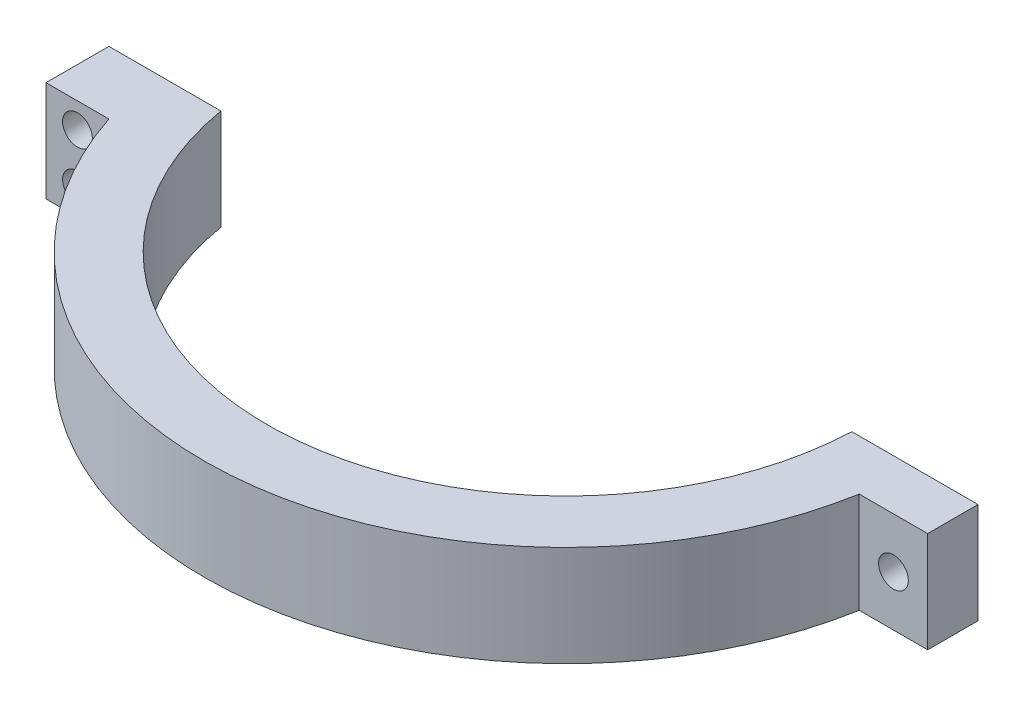
ISO-10303-21;
HEADER;
FILE_DESCRIPTION(('STEP AP214'),'2;1');
FILE_NAME('part.step','',(''),(''),'','','');
FILE_SCHEMA(('AUTOMOTIVE_DESIGN { 1 0 10303 214 1 1 1 1 }'));
ENDSEC;
DATA;
#1=APPLICATION_CONTEXT('core data for automotive mechanical design processes');
#2=APPLICATION_PROTOCOL_DEFINITION('international standard','automotive_design',2000,#1);
#3=PRODUCT_CONTEXT('',#1,'mechanical');
#4=PRODUCT('Part','Part','',(#3));
#5=PRODUCT_RELATED_PRODUCT_CATEGORY('part','',(#4));
#6=PRODUCT_DEFINITION_FORMATION('','',#4);
#7=PRODUCT_DEFINITION_CONTEXT('part definition',#1,'design');
#8=PRODUCT_DEFINITION('design','',#6,#7);
#9=PRODUCT_DEFINITION_SHAPE('','',#8);
#10=(LENGTH_UNIT() NAMED_UNIT(*) SI_UNIT(.MILLI.,.METRE.));
#11=(NAMED_UNIT(*) PLANE_ANGLE_UNIT() SI_UNIT($,.RADIAN.));
#12=(NAMED_UNIT(*) SI_UNIT($,.STERADIAN.) SOLID_ANGLE_UNIT());
#13=UNCERTAINTY_MEASURE_WITH_UNIT(LENGTH_MEASURE(1.E-05),#10,'distance_accuracy_value','');
#14=(GEOMETRIC_REPRESENTATION_CONTEXT(3) GLOBAL_UNCERTAINTY_ASSIGNED_CONTEXT((#13)) GLOBAL_UNIT_ASSIGNED_CONTEXT((#10,
#11,#12)) REPRESENTATION_CONTEXT('',''));
#15=CARTESIAN_POINT('',(0.,0.,0.));
#16=DIRECTION('',(0.,0.,1.));
#17=DIRECTION('',(1.,0.,0.));
#18=AXIS2_PLACEMENT_3D('',#15,#16,#17);
#19=CARTESIAN_POINT('',(0.,10.16,0.));
#20=DIRECTION('',(-1.,0.,0.));
#21=DIRECTION('',(0.,0.,1.));
#22=AXIS2_PLACEMENT_3D('',#19,#20,#21);
#23=PLANE('',#22);
#24=DIRECTION('',(0.,0.,-1.));
#25=VECTOR('',#24,1.);
#26=CARTESIAN_POINT('',(0.,0.,0.));
#27=LINE('',#26,#25);
#28=CARTESIAN_POINT('',(0.,0.,6.35));
#29=VERTEX_POINT('',#28);
#30=CARTESIAN_POINT('',(0.,0.,1.27));
#31=VERTEX_POINT('',#30);
#32=EDGE_CURVE('E139',#29,#31,#27,.T.);
#33=ORIENTED_EDGE('',*,*,#32,.T.);
#34=DIRECTION('',(0.,-1.,0.));
#35=VECTOR('',#34,1.);
#36=CARTESIAN_POINT('',(0.,10.16,1.27));
#37=LINE('',#36,#35);
#38=CARTESIAN_POINT('',(0.,10.16,1.27));
#39=VERTEX_POINT('',#38);
#40=EDGE_CURVE('E56',#39,#31,#37,.T.);
#41=ORIENTED_EDGE('',*,*,#40,.F.);
#42=DIRECTION('',(0.,0.,-1.));
#43=VECTOR('',#42,1.);
#44=CARTESIAN_POINT('',(0.,10.16,0.));
#45=LINE('',#44,#43);
#46=CARTESIAN_POINT('',(0.,10.16,6.35));
#47=VERTEX_POINT('',#46);
#48=EDGE_CURVE('E153',#47,#39,#45,.T.);
#49=ORIENTED_EDGE('',*,*,#48,.F.);
#50=DIRECTION('',(0.,-1.,0.));
#51=VECTOR('',#50,1.);
#52=CARTESIAN_POINT('',(0.,10.16,6.35));
#53=LINE('',#52,#51);
#54=EDGE_CURVE('E135',#47,#29,#53,.T.);
#55=ORIENTED_EDGE('',*,*,#54,.T.);
#56=EDGE_LOOP('',(#33,#41,#49,#55));
#57=FACE_BOUND('',#56,.T.);
#58=ADVANCED_FACE('F40',(#57),#23,.F.);
#59=CARTESIAN_POINT('',(-42.8625,10.16,0.));
#60=DIRECTION('',(0.,-1.,0.));
#61=DIRECTION('',(0.,0.,-1.));
#62=AXIS2_PLACEMENT_3D('',#59,#60,#61);
#63=CYLINDRICAL_SURFACE('',#62,30.1625);
#64=CARTESIAN_POINT('',(-42.8625,10.16,0.));
#65=DIRECTION('',(0.,-1.,0.));
#66=DIRECTION('',(0.,0.,-1.));
#67=AXIS2_PLACEMENT_3D('',#64,#65,#66);
#68=CIRCLE('',#67,30.1625);
#69=CARTESIAN_POINT('',(-12.7267487027451,10.16,1.27000000000001));
#70=VERTEX_POINT('',#69);
#71=CARTESIAN_POINT('',(-72.594133090868,10.16,5.08000000000001));
#72=VERTEX_POINT('',#71);
#73=EDGE_CURVE('E100',#70,#72,#68,.T.);
#74=ORIENTED_EDGE('',*,*,#73,.F.);
#75=DIRECTION('',(0.,-1.,0.));
#76=VECTOR('',#75,1.);
#77=CARTESIAN_POINT('',(-12.7267487027451,10.16,1.27000000000001));
#78=LINE('',#77,#76);
#79=CARTESIAN_POINT('',(-12.7267487027451,0.,1.27000000000001));
#80=VERTEX_POINT('',#79);
#81=EDGE_CURVE('E205',#70,#80,#78,.T.);
#82=ORIENTED_EDGE('',*,*,#81,.T.);
#83=CARTESIAN_POINT('',(-42.8625,0.,0.));
#84=DIRECTION('',(0.,-1.,0.));
#85=DIRECTION('',(0.,0.,-1.));
#86=AXIS2_PLACEMENT_3D('',#83,#84,#85);
#87=CIRCLE('',#86,30.1625);
#88=CARTESIAN_POINT('',(-72.594133090868,0.,5.08000000000001));
#89=VERTEX_POINT('',#88);
#90=EDGE_CURVE('E142',#80,#89,#87,.T.);
#91=ORIENTED_EDGE('',*,*,#90,.T.);
#92=DIRECTION('',(0.,-1.,0.));
#93=VECTOR('',#92,1.);
#94=CARTESIAN_POINT('',(-72.594133090868,10.16,5.08000000000001));
#95=LINE('',#94,#93);
#96=EDGE_CURVE('E11',#72,#89,#95,.T.);
#97=ORIENTED_EDGE('',*,*,#96,.F.);
#98=EDGE_LOOP('',(#74,#82,#91,#97));
#99=FACE_BOUND('',#98,.T.);
#100=ADVANCED_FACE('F185',(#99),#63,.F.);
#101=CARTESIAN_POINT('',(-72.594133090868,10.16,5.07999999999999));
#102=DIRECTION('',(0.,0.,1.));
#103=DIRECTION('',(1.,0.,0.));
#104=AXIS2_PLACEMENT_3D('',#101,#102,#103);
#105=PLANE('',#104);
#106=CARTESIAN_POINT('',(-80.7148377906955,7.62,5.08000000000002));
#107=DIRECTION('',(0.,0.,-1.));
#108=DIRECTION('',(-1.,0.,0.));
#109=AXIS2_PLACEMENT_3D('',#106,#107,#108);
#110=CIRCLE('',#109,1.5);
#111=CARTESIAN_POINT('',(-82.2148377906955,7.62,5.08000000000002));
#112=VERTEX_POINT('',#111);
#113=EDGE_CURVE('E161',#112,#112,#110,.T.);
#114=ORIENTED_EDGE('',*,*,#113,.F.);
#115=EDGE_LOOP('',(#114));
#116=FACE_BOUND('',#115,.T.);
#117=CARTESIAN_POINT('',(-80.7148377906955,2.54,5.08000000000002));
#118=DIRECTION('',(0.,0.,-1.));
#119=DIRECTION('',(-1.,0.,0.));
#120=AXIS2_PLACEMENT_3D('',#117,#118,#119);
#121=CIRCLE('',#120,1.5);
#122=CARTESIAN_POINT('',(-82.2148377906955,2.54,5.08000000000002));
#123=VERTEX_POINT('',#122);
#124=EDGE_CURVE('E211',#123,#123,#121,.T.);
#125=ORIENTED_EDGE('',*,*,#124,.F.);
#126=EDGE_LOOP('',(#125));
#127=FACE_BOUND('',#126,.T.);
#128=DIRECTION('',(-1.,0.,0.));
#129=VECTOR('',#128,1.);
#130=CARTESIAN_POINT('',(-72.594133090868,0.,5.07999999999999));
#131=LINE('',#130,#129);
#132=CARTESIAN_POINT('',(-83.8898377906955,0.,5.07999999999999));
#133=VERTEX_POINT('',#132);
#134=EDGE_CURVE('E145',#89,#133,#131,.T.);
#135=ORIENTED_EDGE('',*,*,#134,.T.);
#136=DIRECTION('',(0.,-1.,0.));
#137=VECTOR('',#136,1.);
#138=CARTESIAN_POINT('',(-83.8898377906955,10.16,5.07999999999999));
#139=LINE('',#138,#137);
#140=CARTESIAN_POINT('',(-83.8898377906955,10.16,5.07999999999999));
#141=VERTEX_POINT('',#140);
#142=EDGE_CURVE('E48',#141,#133,#139,.T.);
#143=ORIENTED_EDGE('',*,*,#142,.F.);
#144=DIRECTION('',(-1.,0.,0.));
#145=VECTOR('',#144,1.);
#146=CARTESIAN_POINT('',(-72.594133090868,10.16,5.07999999999999));
#147=LINE('',#146,#145);
#148=EDGE_CURVE('E217',#72,#141,#147,.T.);
#149=ORIENTED_EDGE('',*,*,#148,.F.);
#150=ORIENTED_EDGE('',*,*,#96,.T.);
#151=EDGE_LOOP('',(#135,#143,#149,#150));
#152=FACE_BOUND('',#151,.T.);
#153=ADVANCED_FACE('F190',(#116,#127,#152),#105,.F.);
#154=CARTESIAN_POINT('',(-83.8898377906955,10.16,5.07999999999999));
#155=DIRECTION('',(1.,0.,0.));
#156=DIRECTION('',(0.,0.,-1.));
#157=AXIS2_PLACEMENT_3D('',#154,#155,#156);
#158=PLANE('',#157);
#159=DIRECTION('',(0.,0.,1.));
#160=VECTOR('',#159,1.);
#161=CARTESIAN_POINT('',(-83.8898377906955,0.,5.07999999999999));
#162=LINE('',#161,#160);
#163=CARTESIAN_POINT('',(-83.8898377906955,0.,11.43));
#164=VERTEX_POINT('',#163);
#165=EDGE_CURVE('E147',#133,#164,#162,.T.);
#166=ORIENTED_EDGE('',*,*,#165,.T.);
#167=DIRECTION('',(0.,-1.,0.));
#168=VECTOR('',#167,1.);
#169=CARTESIAN_POINT('',(-83.8898377906955,10.16,11.43));
#170=LINE('',#169,#168);
#171=CARTESIAN_POINT('',(-83.8898377906955,10.16,11.43));
#172=VERTEX_POINT('',#171);
#173=EDGE_CURVE('E130',#172,#164,#170,.T.);
#174=ORIENTED_EDGE('',*,*,#173,.F.);
#175=DIRECTION('',(0.,0.,1.));
#176=VECTOR('',#175,1.);
#177=CARTESIAN_POINT('',(-83.8898377906955,10.16,5.07999999999999));
#178=LINE('',#177,#176);
#179=EDGE_CURVE('E118',#141,#172,#178,.T.);
#180=ORIENTED_EDGE('',*,*,#179,.F.);
#181=ORIENTED_EDGE('',*,*,#142,.T.);
#182=EDGE_LOOP('',(#166,#174,#180,#181));
#183=FACE_BOUND('',#182,.T.);
#184=ADVANCED_FACE('F223',(#183),#158,.F.);
#185=CARTESIAN_POINT('',(-83.8898377906955,10.16,11.43));
#186=DIRECTION('',(0.,0.,-1.));
#187=DIRECTION('',(-1.,0.,0.));
#188=AXIS2_PLACEMENT_3D('',#185,#186,#187);
#189=PLANE('',#188);
#190=CARTESIAN_POINT('',(-80.7148377906955,7.62,11.43));
#191=DIRECTION('',(0.,0.,-1.));
#192=DIRECTION('',(-1.,0.,0.));
#193=AXIS2_PLACEMENT_3D('',#190,#191,#192);
#194=CIRCLE('',#193,1.5);
#195=CARTESIAN_POINT('',(-82.2148377906955,7.62,11.43));
#196=VERTEX_POINT('',#195);
#197=EDGE_CURVE('E143',#196,#196,#194,.T.);
#198=ORIENTED_EDGE('',*,*,#197,.T.);
#199=EDGE_LOOP('',(#198));
#200=FACE_BOUND('',#199,.T.);
#201=CARTESIAN_POINT('',(-80.7148377906955,2.54,11.43));
#202=DIRECTION('',(0.,0.,-1.));
#203=DIRECTION('',(-1.,0.,0.));
#204=AXIS2_PLACEMENT_3D('',#201,#202,#203);
#205=CIRCLE('',#204,1.5);
#206=CARTESIAN_POINT('',(-82.2148377906955,2.54,11.43));
#207=VERTEX_POINT('',#206);
#208=EDGE_CURVE('E159',#207,#207,#205,.T.);
#209=ORIENTED_EDGE('',*,*,#208,.T.);
#210=EDGE_LOOP('',(#209));
#211=FACE_BOUND('',#210,.T.);
#212=DIRECTION('',(1.,0.,0.));
#213=VECTOR('',#212,1.);
#214=CARTESIAN_POINT('',(-83.8898377906955,0.,11.43));
#215=LINE('',#214,#213);
#216=CARTESIAN_POINT('',(-77.5398377906955,0.,11.43));
#217=VERTEX_POINT('',#216);
#218=EDGE_CURVE('E127',#164,#217,#215,.T.);
#219=ORIENTED_EDGE('',*,*,#218,.T.);
#220=DIRECTION('',(0.,-1.,0.));
#221=VECTOR('',#220,1.);
#222=CARTESIAN_POINT('',(-77.5398377906955,10.16,11.43));
#223=LINE('',#222,#221);
#224=CARTESIAN_POINT('',(-77.5398377906955,10.16,11.43));
#225=VERTEX_POINT('',#224);
#226=EDGE_CURVE('E124',#225,#217,#223,.T.);
#227=ORIENTED_EDGE('',*,*,#226,.F.);
#228=DIRECTION('',(1.,0.,0.));
#229=VECTOR('',#228,1.);
#230=CARTESIAN_POINT('',(-83.8898377906955,10.16,11.43));
#231=LINE('',#230,#229);
#232=EDGE_CURVE('E111',#172,#225,#231,.T.);
#233=ORIENTED_EDGE('',*,*,#232,.F.);
#234=ORIENTED_EDGE('',*,*,#173,.T.);
#235=EDGE_LOOP('',(#219,#227,#233,#234));
#236=FACE_BOUND('',#235,.T.);
#237=ADVANCED_FACE('F125',(#200,#211,#236),#189,.F.);
#238=CARTESIAN_POINT('',(-42.8625,10.16,0.));
#239=DIRECTION('',(0.,-1.,0.));
#240=DIRECTION('',(0.,0.,-1.));
#241=AXIS2_PLACEMENT_3D('',#238,#239,#240);
#242=CYLINDRICAL_SURFACE('',#241,36.5125);
#243=CARTESIAN_POINT('',(-42.8625,0.,0.));
#244=DIRECTION('',(0.,1.,0.));
#245=DIRECTION('',(0.,0.,1.));
#246=AXIS2_PLACEMENT_3D('',#243,#244,#245);
#247=CIRCLE('',#246,36.5125);
#248=CARTESIAN_POINT('',(-6.90641350202305,0.,6.35));
#249=VERTEX_POINT('',#248);
#250=EDGE_CURVE('E150',#217,#249,#247,.T.);
#251=ORIENTED_EDGE('',*,*,#250,.T.);
#252=DIRECTION('',(0.,-1.,0.));
#253=VECTOR('',#252,1.);
#254=CARTESIAN_POINT('',(-6.90641350202305,10.16,6.35));
#255=LINE('',#254,#253);
#256=CARTESIAN_POINT('',(-6.90641350202305,10.16,6.35));
#257=VERTEX_POINT('',#256);
#258=EDGE_CURVE('E131',#257,#249,#255,.T.);
#259=ORIENTED_EDGE('',*,*,#258,.F.);
#260=CARTESIAN_POINT('',(-42.8625,10.16,0.));
#261=DIRECTION('',(0.,1.,0.));
#262=DIRECTION('',(0.,0.,1.));
#263=AXIS2_PLACEMENT_3D('',#260,#261,#262);
#264=CIRCLE('',#263,36.5125);
#265=EDGE_CURVE('E115',#225,#257,#264,.T.);
#266=ORIENTED_EDGE('',*,*,#265,.F.);
#267=ORIENTED_EDGE('',*,*,#226,.T.);
#268=EDGE_LOOP('',(#251,#259,#266,#267));
#269=FACE_BOUND('',#268,.T.);
#270=ADVANCED_FACE('F133',(#269),#242,.T.);
#271=CARTESIAN_POINT('',(0.,10.16,6.35));
#272=DIRECTION('',(0.,0.,-1.));
#273=DIRECTION('',(-1.,0.,0.));
#274=AXIS2_PLACEMENT_3D('',#271,#272,#273);
#275=PLANE('',#274);
#276=CARTESIAN_POINT('',(-3.45320675101152,5.08,6.35));
#277=DIRECTION('',(0.,0.,1.));
#278=DIRECTION('',(1.,0.,0.));
#279=AXIS2_PLACEMENT_3D('',#276,#277,#278);
#280=CIRCLE('',#279,1.5);
#281=CARTESIAN_POINT('',(-1.95320675101152,5.08,6.35));
#282=VERTEX_POINT('',#281);
#283=EDGE_CURVE('E208',#282,#282,#280,.T.);
#284=ORIENTED_EDGE('',*,*,#283,.F.);
#285=EDGE_LOOP('',(#284));
#286=FACE_BOUND('',#285,.T.);
#287=DIRECTION('',(1.,0.,0.));
#288=VECTOR('',#287,1.);
#289=CARTESIAN_POINT('',(0.,0.,6.35));
#290=LINE('',#289,#288);
#291=EDGE_CURVE('E92',#249,#29,#290,.T.);
#292=ORIENTED_EDGE('',*,*,#291,.T.);
#293=ORIENTED_EDGE('',*,*,#54,.F.);
#294=DIRECTION('',(1.,0.,0.));
#295=VECTOR('',#294,1.);
#296=CARTESIAN_POINT('',(0.,10.16,6.35));
#297=LINE('',#296,#295);
#298=EDGE_CURVE('E65',#257,#47,#297,.T.);
#299=ORIENTED_EDGE('',*,*,#298,.F.);
#300=ORIENTED_EDGE('',*,*,#258,.T.);
#301=EDGE_LOOP('',(#292,#293,#299,#300));
#302=FACE_BOUND('',#301,.T.);
#303=ADVANCED_FACE('F224',(#286,#302),#275,.F.);
#304=CARTESIAN_POINT('',(-42.8625,10.16,0.));
#305=DIRECTION('',(0.,1.,0.));
#306=DIRECTION('',(0.,0.,1.));
#307=AXIS2_PLACEMENT_3D('',#304,#305,#306);
#308=PLANE('',#307);
#309=DIRECTION('',(-1.,0.,0.));
#310=VECTOR('',#309,1.);
#311=CARTESIAN_POINT('',(-12.7267487027451,10.16,1.27000000000001));
#312=LINE('',#311,#310);
#313=EDGE_CURVE('E201',#39,#70,#312,.T.);
#314=ORIENTED_EDGE('',*,*,#313,.T.);
#315=ORIENTED_EDGE('',*,*,#73,.T.);
#316=ORIENTED_EDGE('',*,*,#148,.T.);
#317=ORIENTED_EDGE('',*,*,#179,.T.);
#318=ORIENTED_EDGE('',*,*,#232,.T.);
#319=ORIENTED_EDGE('',*,*,#265,.T.);
#320=ORIENTED_EDGE('',*,*,#298,.T.);
#321=ORIENTED_EDGE('',*,*,#48,.T.);
#322=EDGE_LOOP('',(#314,#315,#316,#317,#318,#319,#320,#321));
#323=FACE_BOUND('',#322,.T.);
#324=ADVANCED_FACE('F113',(#323),#308,.T.);
#325=CARTESIAN_POINT('',(-42.8625,0.,0.));
#326=DIRECTION('',(0.,1.,0.));
#327=DIRECTION('',(0.,0.,1.));
#328=AXIS2_PLACEMENT_3D('',#325,#326,#327);
#329=PLANE('',#328);
#330=ORIENTED_EDGE('',*,*,#90,.F.);
#331=DIRECTION('',(-1.,0.,0.));
#332=VECTOR('',#331,1.);
#333=CARTESIAN_POINT('',(-12.7267487027451,0.,1.27000000000001));
#334=LINE('',#333,#332);
#335=EDGE_CURVE('E197',#31,#80,#334,.T.);
#336=ORIENTED_EDGE('',*,*,#335,.F.);
#337=ORIENTED_EDGE('',*,*,#32,.F.);
#338=ORIENTED_EDGE('',*,*,#291,.F.);
#339=ORIENTED_EDGE('',*,*,#250,.F.);
#340=ORIENTED_EDGE('',*,*,#218,.F.);
#341=ORIENTED_EDGE('',*,*,#165,.F.);
#342=ORIENTED_EDGE('',*,*,#134,.F.);
#343=EDGE_LOOP('',(#330,#336,#337,#338,#339,#340,#341,#342));
#344=FACE_BOUND('',#343,.T.);
#345=ADVANCED_FACE('F180',(#344),#329,.F.);
#346=CARTESIAN_POINT('',(-80.7148377906955,2.54,36.5125));
#347=DIRECTION('',(0.,0.,-1.));
#348=DIRECTION('',(-1.,0.,0.));
#349=AXIS2_PLACEMENT_3D('',#346,#347,#348);
#350=CYLINDRICAL_SURFACE('',#349,1.5);
#351=ORIENTED_EDGE('',*,*,#124,.T.);
#352=EDGE_LOOP('',(#351));
#353=FACE_BOUND('',#352,.T.);
#354=ORIENTED_EDGE('',*,*,#208,.F.);
#355=EDGE_LOOP('',(#354));
#356=FACE_BOUND('',#355,.T.);
#357=ADVANCED_FACE('F170',(#353,#356),#350,.F.);
#358=CARTESIAN_POINT('',(-80.7148377906955,7.62,36.5125));
#359=DIRECTION('',(0.,0.,-1.));
#360=DIRECTION('',(-1.,0.,0.));
#361=AXIS2_PLACEMENT_3D('',#358,#359,#360);
#362=CYLINDRICAL_SURFACE('',#361,1.5);
#363=ORIENTED_EDGE('',*,*,#113,.T.);
#364=EDGE_LOOP('',(#363));
#365=FACE_BOUND('',#364,.T.);
#366=ORIENTED_EDGE('',*,*,#197,.F.);
#367=EDGE_LOOP('',(#366));
#368=FACE_BOUND('',#367,.T.);
#369=ADVANCED_FACE('F167',(#365,#368),#362,.F.);
#370=CARTESIAN_POINT('',(-3.45320675101152,5.08,0.));
#371=DIRECTION('',(0.,0.,1.));
#372=DIRECTION('',(1.,0.,0.));
#373=AXIS2_PLACEMENT_3D('',#370,#371,#372);
#374=CYLINDRICAL_SURFACE('',#373,1.5);
#375=CARTESIAN_POINT('',(-3.45320675101152,5.08,1.27));
#376=DIRECTION('',(0.,0.,1.));
#377=DIRECTION('',(1.,0.,0.));
#378=AXIS2_PLACEMENT_3D('',#375,#376,#377);
#379=CIRCLE('',#378,1.5);
#380=CARTESIAN_POINT('',(-1.95320675101152,5.08,1.27));
#381=VERTEX_POINT('',#380);
#382=EDGE_CURVE('E43',#381,#381,#379,.F.);
#383=ORIENTED_EDGE('',*,*,#382,.T.);
#384=EDGE_LOOP('',(#383));
#385=FACE_BOUND('',#384,.T.);
#386=ORIENTED_EDGE('',*,*,#283,.T.);
#387=EDGE_LOOP('',(#386));
#388=FACE_BOUND('',#387,.T.);
#389=ADVANCED_FACE('F169',(#385,#388),#374,.F.);
#390=CARTESIAN_POINT('',(-12.7267487027451,10.16,1.27000000000001));
#391=DIRECTION('',(0.,0.,1.));
#392=DIRECTION('',(1.,0.,0.));
#393=AXIS2_PLACEMENT_3D('',#390,#391,#392);
#394=PLANE('',#393);
#395=ORIENTED_EDGE('',*,*,#335,.T.);
#396=ORIENTED_EDGE('',*,*,#81,.F.);
#397=ORIENTED_EDGE('',*,*,#313,.F.);
#398=ORIENTED_EDGE('',*,*,#40,.T.);
#399=EDGE_LOOP('',(#395,#396,#397,#398));
#400=FACE_BOUND('',#399,.T.);
#401=ORIENTED_EDGE('',*,*,#382,.F.);
#402=EDGE_LOOP('',(#401));
#403=FACE_BOUND('',#402,.T.);
#404=ADVANCED_FACE('F177',(#400,#403),#394,.F.);
#405=CLOSED_SHELL('',(#58,#100,#153,#184,#237,#270,#303,#324,#345,#357,#369,#389,#404));
#406=MANIFOLD_SOLID_BREP('B2',#405);
#407=ADVANCED_BREP_SHAPE_REPRESENTATION('',(#18,#406),#14);
#408=SHAPE_DEFINITION_REPRESENTATION(#9,#407);
ENDSEC;
END-ISO-10303-21;
